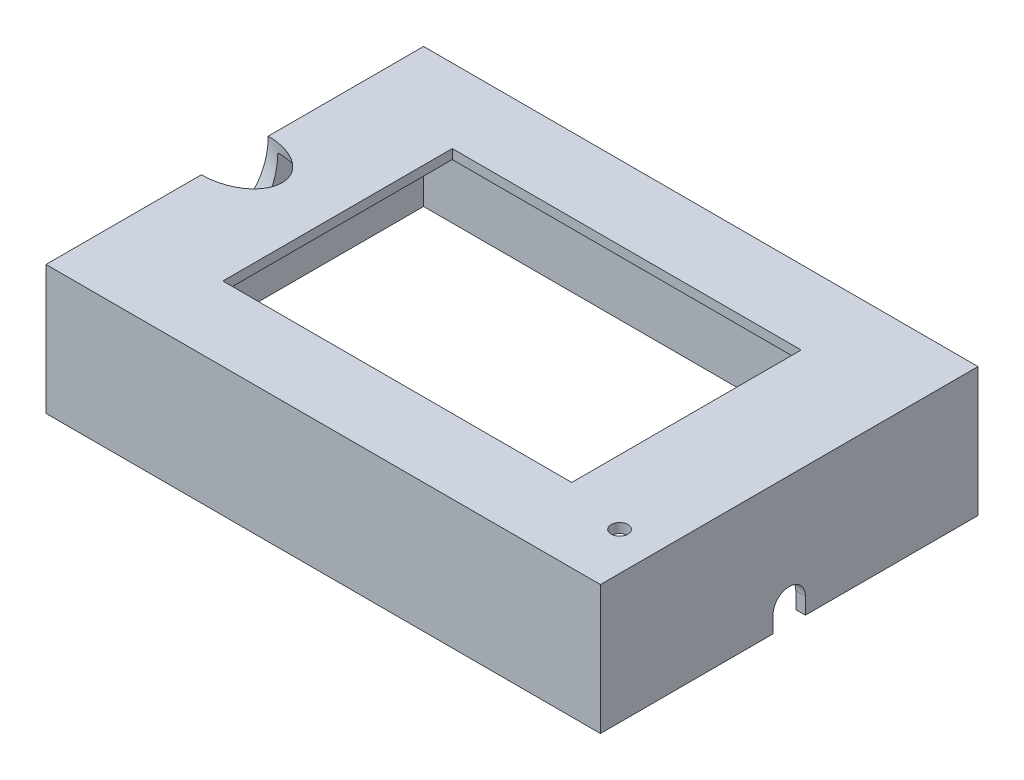
ISO-10303-21;
HEADER;
FILE_DESCRIPTION(('STEP AP214'),'2;1');
FILE_NAME('part.step','',(''),(''),'','','');
FILE_SCHEMA(('AUTOMOTIVE_DESIGN { 1 0 10303 214 1 1 1 1 }'));
ENDSEC;
DATA;
#1=APPLICATION_CONTEXT('core data for automotive mechanical design processes');
#2=APPLICATION_PROTOCOL_DEFINITION('international standard','automotive_design',2000,#1);
#3=PRODUCT_CONTEXT('',#1,'mechanical');
#4=PRODUCT('Part','Part','',(#3));
#5=PRODUCT_RELATED_PRODUCT_CATEGORY('part','',(#4));
#6=PRODUCT_DEFINITION_FORMATION('','',#4);
#7=PRODUCT_DEFINITION_CONTEXT('part definition',#1,'design');
#8=PRODUCT_DEFINITION('design','',#6,#7);
#9=PRODUCT_DEFINITION_SHAPE('','',#8);
#10=(LENGTH_UNIT() NAMED_UNIT(*) SI_UNIT(.MILLI.,.METRE.));
#11=(NAMED_UNIT(*) PLANE_ANGLE_UNIT() SI_UNIT($,.RADIAN.));
#12=(NAMED_UNIT(*) SI_UNIT($,.STERADIAN.) SOLID_ANGLE_UNIT());
#13=UNCERTAINTY_MEASURE_WITH_UNIT(LENGTH_MEASURE(1.E-05),#10,'distance_accuracy_value','');
#14=(GEOMETRIC_REPRESENTATION_CONTEXT(3) GLOBAL_UNCERTAINTY_ASSIGNED_CONTEXT((#13)) GLOBAL_UNIT_ASSIGNED_CONTEXT((#10,
#11,#12)) REPRESENTATION_CONTEXT('',''));
#15=CARTESIAN_POINT('',(0.,0.,0.));
#16=DIRECTION('',(0.,0.,1.));
#17=DIRECTION('',(1.,0.,0.));
#18=AXIS2_PLACEMENT_3D('',#15,#16,#17);
#19=CARTESIAN_POINT('',(-58.,25.,39.5));
#20=DIRECTION('',(1.,0.,0.));
#21=DIRECTION('',(0.,0.,-1.));
#22=AXIS2_PLACEMENT_3D('',#19,#20,#21);
#23=PLANE('',#22);
#24=CARTESIAN_POINT('',(-58.,27.,0.));
#25=DIRECTION('',(1.,0.,0.));
#26=DIRECTION('',(0.,1.,0.));
#27=AXIS2_PLACEMENT_3D('',#24,#25,#26);
#28=ELLIPSE('',#27,9.89949493661166,7.);
#29=CARTESIAN_POINT('',(-58.,27.,-7.));
#30=VERTEX_POINT('',#29);
#31=CARTESIAN_POINT('',(-58.,27.,7.));
#32=VERTEX_POINT('',#31);
#33=EDGE_CURVE('E286',#30,#32,#28,.F.);
#34=ORIENTED_EDGE('',*,*,#33,.F.);
#35=DIRECTION('',(0.,0.,1.));
#36=VECTOR('',#35,1.);
#37=CARTESIAN_POINT('',(-58.,27.,39.5));
#38=LINE('',#37,#36);
#39=CARTESIAN_POINT('',(-58.,27.,-39.5));
#40=VERTEX_POINT('',#39);
#41=EDGE_CURVE('E244',#40,#30,#38,.T.);
#42=ORIENTED_EDGE('',*,*,#41,.F.);
#43=DIRECTION('',(0.,-1.,0.));
#44=VECTOR('',#43,1.);
#45=CARTESIAN_POINT('',(-58.,25.,-39.5));
#46=LINE('',#45,#44);
#47=CARTESIAN_POINT('',(-58.,0.,-39.5));
#48=VERTEX_POINT('',#47);
#49=EDGE_CURVE('E219',#40,#48,#46,.T.);
#50=ORIENTED_EDGE('',*,*,#49,.T.);
#51=DIRECTION('',(0.,0.,1.));
#52=VECTOR('',#51,1.);
#53=CARTESIAN_POINT('',(-58.,0.,39.5));
#54=LINE('',#53,#52);
#55=CARTESIAN_POINT('',(-58.,0.,39.5));
#56=VERTEX_POINT('',#55);
#57=EDGE_CURVE('E209',#48,#56,#54,.T.);
#58=ORIENTED_EDGE('',*,*,#57,.T.);
#59=DIRECTION('',(0.,-1.,0.));
#60=VECTOR('',#59,1.);
#61=CARTESIAN_POINT('',(-58.,25.,39.5));
#62=LINE('',#61,#60);
#63=CARTESIAN_POINT('',(-58.,27.,39.5));
#64=VERTEX_POINT('',#63);
#65=EDGE_CURVE('E216',#64,#56,#62,.T.);
#66=ORIENTED_EDGE('',*,*,#65,.F.);
#67=EDGE_CURVE('E322',#32,#64,#38,.T.);
#68=ORIENTED_EDGE('',*,*,#67,.F.);
#69=EDGE_LOOP('',(#34,#42,#50,#58,#66,#68));
#70=FACE_BOUND('',#69,.T.);
#71=ADVANCED_FACE('F33',(#70),#23,.F.);
#72=CARTESIAN_POINT('',(-56.,25.,37.5));
#73=DIRECTION('',(1.,0.,0.));
#74=DIRECTION('',(0.,0.,-1.));
#75=AXIS2_PLACEMENT_3D('',#72,#73,#74);
#76=PLANE('',#75);
#77=DIRECTION('',(0.,0.,1.));
#78=VECTOR('',#77,1.);
#79=CARTESIAN_POINT('',(-56.,25.,37.5));
#80=LINE('',#79,#78);
#81=CARTESIAN_POINT('',(-56.,25.,-37.5));
#82=VERTEX_POINT('',#81);
#83=CARTESIAN_POINT('',(-56.,25.,-7.));
#84=VERTEX_POINT('',#83);
#85=EDGE_CURVE('E248',#82,#84,#80,.T.);
#86=ORIENTED_EDGE('',*,*,#85,.T.);
#87=CARTESIAN_POINT('',(-56.,25.,0.));
#88=DIRECTION('',(1.,0.,0.));
#89=DIRECTION('',(0.,1.,0.));
#90=AXIS2_PLACEMENT_3D('',#87,#88,#89);
#91=ELLIPSE('',#90,9.89949493661166,7.);
#92=CARTESIAN_POINT('',(-56.,25.,7.));
#93=VERTEX_POINT('',#92);
#94=EDGE_CURVE('E55',#84,#93,#91,.F.);
#95=ORIENTED_EDGE('',*,*,#94,.T.);
#96=CARTESIAN_POINT('',(-56.,25.,37.5));
#97=VERTEX_POINT('',#96);
#98=EDGE_CURVE('E187',#93,#97,#80,.T.);
#99=ORIENTED_EDGE('',*,*,#98,.T.);
#100=DIRECTION('',(0.,-1.,0.));
#101=VECTOR('',#100,1.);
#102=CARTESIAN_POINT('',(-56.,25.,37.5));
#103=LINE('',#102,#101);
#104=CARTESIAN_POINT('',(-56.,0.,37.5));
#105=VERTEX_POINT('',#104);
#106=EDGE_CURVE('E201',#97,#105,#103,.T.);
#107=ORIENTED_EDGE('',*,*,#106,.T.);
#108=DIRECTION('',(0.,0.,1.));
#109=VECTOR('',#108,1.);
#110=CARTESIAN_POINT('',(-56.,0.,37.5));
#111=LINE('',#110,#109);
#112=CARTESIAN_POINT('',(-56.,0.,-37.5));
#113=VERTEX_POINT('',#112);
#114=EDGE_CURVE('E242',#113,#105,#111,.T.);
#115=ORIENTED_EDGE('',*,*,#114,.F.);
#116=DIRECTION('',(0.,-1.,0.));
#117=VECTOR('',#116,1.);
#118=CARTESIAN_POINT('',(-56.,25.,-37.5));
#119=LINE('',#118,#117);
#120=EDGE_CURVE('E192',#82,#113,#119,.T.);
#121=ORIENTED_EDGE('',*,*,#120,.F.);
#122=EDGE_LOOP('',(#86,#95,#99,#107,#115,#121));
#123=FACE_BOUND('',#122,.T.);
#124=ADVANCED_FACE('F261',(#123),#76,.T.);
#125=CARTESIAN_POINT('',(0.,25.,0.));
#126=DIRECTION('',(0.,1.,0.));
#127=DIRECTION('',(0.,0.,1.));
#128=AXIS2_PLACEMENT_3D('',#125,#126,#127);
#129=PLANE('',#128);
#130=DIRECTION('',(-1.,0.,0.));
#131=VECTOR('',#130,1.);
#132=CARTESIAN_POINT('',(-36.5,25.,24.));
#133=LINE('',#132,#131);
#134=CARTESIAN_POINT('',(36.5,25.,24.));
#135=VERTEX_POINT('',#134);
#136=CARTESIAN_POINT('',(-36.5,25.,24.));
#137=VERTEX_POINT('',#136);
#138=EDGE_CURVE('E298',#135,#137,#133,.T.);
#139=ORIENTED_EDGE('',*,*,#138,.F.);
#140=DIRECTION('',(0.,0.,1.));
#141=VECTOR('',#140,1.);
#142=CARTESIAN_POINT('',(36.5,25.,-24.));
#143=LINE('',#142,#141);
#144=CARTESIAN_POINT('',(36.5,25.,-24.));
#145=VERTEX_POINT('',#144);
#146=EDGE_CURVE('E301',#145,#135,#143,.T.);
#147=ORIENTED_EDGE('',*,*,#146,.F.);
#148=DIRECTION('',(1.,0.,0.));
#149=VECTOR('',#148,1.);
#150=CARTESIAN_POINT('',(-36.5,25.,-24.));
#151=LINE('',#150,#149);
#152=CARTESIAN_POINT('',(-36.5,25.,-24.));
#153=VERTEX_POINT('',#152);
#154=EDGE_CURVE('E303',#153,#145,#151,.T.);
#155=ORIENTED_EDGE('',*,*,#154,.F.);
#156=DIRECTION('',(0.,0.,-1.));
#157=VECTOR('',#156,1.);
#158=CARTESIAN_POINT('',(-36.5,25.,-24.));
#159=LINE('',#158,#157);
#160=EDGE_CURVE('E295',#137,#153,#159,.T.);
#161=ORIENTED_EDGE('',*,*,#160,.F.);
#162=EDGE_LOOP('',(#139,#147,#155,#161));
#163=FACE_BOUND('',#162,.T.);
#164=CARTESIAN_POINT('',(50.,25.,27.5));
#165=DIRECTION('',(0.,1.,0.));
#166=DIRECTION('',(0.,0.,1.));
#167=AXIS2_PLACEMENT_3D('',#164,#165,#166);
#168=CIRCLE('',#167,1.75);
#169=CARTESIAN_POINT('',(50.,25.,29.25));
#170=VERTEX_POINT('',#169);
#171=EDGE_CURVE('E291',#170,#170,#168,.F.);
#172=ORIENTED_EDGE('',*,*,#171,.F.);
#173=EDGE_LOOP('',(#172));
#174=FACE_BOUND('',#173,.T.);
#175=CARTESIAN_POINT('',(-56.,25.,0.));
#176=DIRECTION('',(0.,1.,0.));
#177=DIRECTION('',(-1.,0.,0.));
#178=AXIS2_PLACEMENT_3D('',#175,#176,#177);
#179=ELLIPSE('',#178,9.89949493661167,7.);
#180=EDGE_CURVE('E270',#84,#93,#179,.F.);
#181=ORIENTED_EDGE('',*,*,#180,.F.);
#182=ORIENTED_EDGE('',*,*,#85,.F.);
#183=DIRECTION('',(-1.,0.,0.));
#184=VECTOR('',#183,1.);
#185=CARTESIAN_POINT('',(56.,25.,-37.5));
#186=LINE('',#185,#184);
#187=CARTESIAN_POINT('',(56.,25.,-37.5));
#188=VERTEX_POINT('',#187);
#189=EDGE_CURVE('E196',#188,#82,#186,.T.);
#190=ORIENTED_EDGE('',*,*,#189,.F.);
#191=DIRECTION('',(0.,0.,-1.));
#192=VECTOR('',#191,1.);
#193=CARTESIAN_POINT('',(56.,25.,37.5));
#194=LINE('',#193,#192);
#195=CARTESIAN_POINT('',(56.,25.,37.5));
#196=VERTEX_POINT('',#195);
#197=EDGE_CURVE('E254',#196,#188,#194,.T.);
#198=ORIENTED_EDGE('',*,*,#197,.F.);
#199=DIRECTION('',(1.,0.,0.));
#200=VECTOR('',#199,1.);
#201=CARTESIAN_POINT('',(56.,25.,37.5));
#202=LINE('',#201,#200);
#203=EDGE_CURVE('E251',#97,#196,#202,.T.);
#204=ORIENTED_EDGE('',*,*,#203,.F.);
#205=ORIENTED_EDGE('',*,*,#98,.F.);
#206=EDGE_LOOP('',(#181,#182,#190,#198,#204,#205));
#207=FACE_BOUND('',#206,.T.);
#208=ADVANCED_FACE('F267',(#163,#174,#207),#129,.F.);
#209=CARTESIAN_POINT('',(0.,27.,0.));
#210=DIRECTION('',(0.,1.,0.));
#211=DIRECTION('',(0.,0.,1.));
#212=AXIS2_PLACEMENT_3D('',#209,#210,#211);
#213=PLANE('',#212);
#214=DIRECTION('',(0.,0.,-1.));
#215=VECTOR('',#214,1.);
#216=CARTESIAN_POINT('',(36.5,27.,-24.));
#217=LINE('',#216,#215);
#218=CARTESIAN_POINT('',(36.5,27.,24.));
#219=VERTEX_POINT('',#218);
#220=CARTESIAN_POINT('',(36.5,27.,-24.));
#221=VERTEX_POINT('',#220);
#222=EDGE_CURVE('E294',#219,#221,#217,.T.);
#223=ORIENTED_EDGE('',*,*,#222,.F.);
#224=DIRECTION('',(1.,0.,0.));
#225=VECTOR('',#224,1.);
#226=CARTESIAN_POINT('',(-36.5,27.,24.));
#227=LINE('',#226,#225);
#228=CARTESIAN_POINT('',(-36.5,27.,24.));
#229=VERTEX_POINT('',#228);
#230=EDGE_CURVE('E311',#229,#219,#227,.T.);
#231=ORIENTED_EDGE('',*,*,#230,.F.);
#232=DIRECTION('',(0.,0.,1.));
#233=VECTOR('',#232,1.);
#234=CARTESIAN_POINT('',(-36.5,27.,-24.));
#235=LINE('',#234,#233);
#236=CARTESIAN_POINT('',(-36.5,27.,-24.));
#237=VERTEX_POINT('',#236);
#238=EDGE_CURVE('E308',#237,#229,#235,.T.);
#239=ORIENTED_EDGE('',*,*,#238,.F.);
#240=DIRECTION('',(-1.,0.,0.));
#241=VECTOR('',#240,1.);
#242=CARTESIAN_POINT('',(-36.5,27.,-24.));
#243=LINE('',#242,#241);
#244=EDGE_CURVE('E305',#221,#237,#243,.T.);
#245=ORIENTED_EDGE('',*,*,#244,.F.);
#246=EDGE_LOOP('',(#223,#231,#239,#245));
#247=FACE_BOUND('',#246,.T.);
#248=CARTESIAN_POINT('',(50.,27.,27.5));
#249=DIRECTION('',(0.,1.,0.));
#250=DIRECTION('',(0.,0.,1.));
#251=AXIS2_PLACEMENT_3D('',#248,#249,#250);
#252=CIRCLE('',#251,1.75);
#253=CARTESIAN_POINT('',(50.,27.,29.25));
#254=VERTEX_POINT('',#253);
#255=EDGE_CURVE('E271',#254,#254,#252,.T.);
#256=ORIENTED_EDGE('',*,*,#255,.F.);
#257=EDGE_LOOP('',(#256));
#258=FACE_BOUND('',#257,.T.);
#259=ORIENTED_EDGE('',*,*,#41,.T.);
#260=CARTESIAN_POINT('',(-58.,27.,0.));
#261=DIRECTION('',(0.,1.,0.));
#262=DIRECTION('',(-1.,0.,0.));
#263=AXIS2_PLACEMENT_3D('',#260,#261,#262);
#264=ELLIPSE('',#263,9.89949493661167,7.);
#265=EDGE_CURVE('E11',#30,#32,#264,.F.);
#266=ORIENTED_EDGE('',*,*,#265,.T.);
#267=ORIENTED_EDGE('',*,*,#67,.T.);
#268=DIRECTION('',(1.,0.,0.));
#269=VECTOR('',#268,1.);
#270=CARTESIAN_POINT('',(58.,27.,39.5));
#271=LINE('',#270,#269);
#272=CARTESIAN_POINT('',(58.,27.,39.5));
#273=VERTEX_POINT('',#272);
#274=EDGE_CURVE('E240',#64,#273,#271,.T.);
#275=ORIENTED_EDGE('',*,*,#274,.T.);
#276=DIRECTION('',(0.,0.,-1.));
#277=VECTOR('',#276,1.);
#278=CARTESIAN_POINT('',(58.,27.,39.5));
#279=LINE('',#278,#277);
#280=CARTESIAN_POINT('',(58.,27.,-39.5));
#281=VERTEX_POINT('',#280);
#282=EDGE_CURVE('E231',#273,#281,#279,.T.);
#283=ORIENTED_EDGE('',*,*,#282,.T.);
#284=DIRECTION('',(-1.,0.,0.));
#285=VECTOR('',#284,1.);
#286=CARTESIAN_POINT('',(58.,27.,-39.5));
#287=LINE('',#286,#285);
#288=EDGE_CURVE('E227',#281,#40,#287,.T.);
#289=ORIENTED_EDGE('',*,*,#288,.T.);
#290=EDGE_LOOP('',(#259,#266,#267,#275,#283,#289));
#291=FACE_BOUND('',#290,.T.);
#292=ADVANCED_FACE('F237',(#247,#258,#291),#213,.T.);
#293=CARTESIAN_POINT('',(0.,0.,0.));
#294=DIRECTION('',(0.,1.,0.));
#295=DIRECTION('',(0.,0.,1.));
#296=AXIS2_PLACEMENT_3D('',#293,#294,#295);
#297=PLANE('',#296);
#298=DIRECTION('',(0.,0.,-1.));
#299=VECTOR('',#298,1.);
#300=CARTESIAN_POINT('',(56.,0.,37.5));
#301=LINE('',#300,#299);
#302=CARTESIAN_POINT('',(56.,0.,37.5));
#303=VERTEX_POINT('',#302);
#304=CARTESIAN_POINT('',(56.,0.,3.375));
#305=VERTEX_POINT('',#304);
#306=EDGE_CURVE('E174',#303,#305,#301,.T.);
#307=ORIENTED_EDGE('',*,*,#306,.T.);
#308=DIRECTION('',(1.,0.,0.));
#309=VECTOR('',#308,1.);
#310=CARTESIAN_POINT('',(46.3652646637284,0.,3.375));
#311=LINE('',#310,#309);
#312=CARTESIAN_POINT('',(58.,0.,3.375));
#313=VERTEX_POINT('',#312);
#314=EDGE_CURVE('E157',#305,#313,#311,.T.);
#315=ORIENTED_EDGE('',*,*,#314,.T.);
#316=DIRECTION('',(0.,0.,-1.));
#317=VECTOR('',#316,1.);
#318=CARTESIAN_POINT('',(58.,0.,39.5));
#319=LINE('',#318,#317);
#320=CARTESIAN_POINT('',(58.,0.,39.5));
#321=VERTEX_POINT('',#320);
#322=EDGE_CURVE('E205',#321,#313,#319,.T.);
#323=ORIENTED_EDGE('',*,*,#322,.F.);
#324=DIRECTION('',(1.,0.,0.));
#325=VECTOR('',#324,1.);
#326=CARTESIAN_POINT('',(58.,0.,39.5));
#327=LINE('',#326,#325);
#328=EDGE_CURVE('E211',#56,#321,#327,.T.);
#329=ORIENTED_EDGE('',*,*,#328,.F.);
#330=ORIENTED_EDGE('',*,*,#57,.F.);
#331=DIRECTION('',(-1.,0.,0.));
#332=VECTOR('',#331,1.);
#333=CARTESIAN_POINT('',(58.,0.,-39.5));
#334=LINE('',#333,#332);
#335=CARTESIAN_POINT('',(58.,0.,-39.5));
#336=VERTEX_POINT('',#335);
#337=EDGE_CURVE('E207',#336,#48,#334,.T.);
#338=ORIENTED_EDGE('',*,*,#337,.F.);
#339=CARTESIAN_POINT('',(58.,0.,-3.375));
#340=VERTEX_POINT('',#339);
#341=EDGE_CURVE('E204',#340,#336,#319,.T.);
#342=ORIENTED_EDGE('',*,*,#341,.F.);
#343=DIRECTION('',(1.,0.,0.));
#344=VECTOR('',#343,1.);
#345=CARTESIAN_POINT('',(46.3652646637284,0.,-3.375));
#346=LINE('',#345,#344);
#347=CARTESIAN_POINT('',(56.,0.,-3.375));
#348=VERTEX_POINT('',#347);
#349=EDGE_CURVE('E168',#348,#340,#346,.T.);
#350=ORIENTED_EDGE('',*,*,#349,.F.);
#351=CARTESIAN_POINT('',(56.,0.,-37.5));
#352=VERTEX_POINT('',#351);
#353=EDGE_CURVE('E184',#348,#352,#301,.T.);
#354=ORIENTED_EDGE('',*,*,#353,.T.);
#355=DIRECTION('',(-1.,0.,0.));
#356=VECTOR('',#355,1.);
#357=CARTESIAN_POINT('',(56.,0.,-37.5));
#358=LINE('',#357,#356);
#359=EDGE_CURVE('E183',#352,#113,#358,.T.);
#360=ORIENTED_EDGE('',*,*,#359,.T.);
#361=ORIENTED_EDGE('',*,*,#114,.T.);
#362=DIRECTION('',(1.,0.,0.));
#363=VECTOR('',#362,1.);
#364=CARTESIAN_POINT('',(56.,0.,37.5));
#365=LINE('',#364,#363);
#366=EDGE_CURVE('E182',#105,#303,#365,.T.);
#367=ORIENTED_EDGE('',*,*,#366,.T.);
#368=EDGE_LOOP('',(#307,#315,#323,#329,#330,#338,#342,#350,#354,#360,#361,#367));
#369=FACE_BOUND('',#368,.T.);
#370=ADVANCED_FACE('F180',(#369),#297,.F.);
#371=CARTESIAN_POINT('',(58.,25.,39.5));
#372=DIRECTION('',(-1.,0.,0.));
#373=DIRECTION('',(0.,0.,1.));
#374=AXIS2_PLACEMENT_3D('',#371,#372,#373);
#375=PLANE('',#374);
#376=ORIENTED_EDGE('',*,*,#322,.T.);
#377=DIRECTION('',(0.,-1.,0.));
#378=VECTOR('',#377,1.);
#379=CARTESIAN_POINT('',(58.,3.5,3.375));
#380=LINE('',#379,#378);
#381=CARTESIAN_POINT('',(58.,3.5,3.375));
#382=VERTEX_POINT('',#381);
#383=EDGE_CURVE('E163',#382,#313,#380,.T.);
#384=ORIENTED_EDGE('',*,*,#383,.F.);
#385=CARTESIAN_POINT('',(58.,3.5,0.));
#386=DIRECTION('',(1.,0.,0.));
#387=DIRECTION('',(0.,0.,-1.));
#388=AXIS2_PLACEMENT_3D('',#385,#386,#387);
#389=CIRCLE('',#388,3.375);
#390=CARTESIAN_POINT('',(58.,3.5,-3.375));
#391=VERTEX_POINT('',#390);
#392=EDGE_CURVE('E332',#391,#382,#389,.T.);
#393=ORIENTED_EDGE('',*,*,#392,.F.);
#394=DIRECTION('',(0.,1.,0.));
#395=VECTOR('',#394,1.);
#396=CARTESIAN_POINT('',(58.,3.5,-3.375));
#397=LINE('',#396,#395);
#398=EDGE_CURVE('E178',#340,#391,#397,.T.);
#399=ORIENTED_EDGE('',*,*,#398,.F.);
#400=ORIENTED_EDGE('',*,*,#341,.T.);
#401=DIRECTION('',(0.,-1.,0.));
#402=VECTOR('',#401,1.);
#403=CARTESIAN_POINT('',(58.,25.,-39.5));
#404=LINE('',#403,#402);
#405=EDGE_CURVE('E41',#281,#336,#404,.T.);
#406=ORIENTED_EDGE('',*,*,#405,.F.);
#407=ORIENTED_EDGE('',*,*,#282,.F.);
#408=DIRECTION('',(0.,-1.,0.));
#409=VECTOR('',#408,1.);
#410=CARTESIAN_POINT('',(58.,25.,39.5));
#411=LINE('',#410,#409);
#412=EDGE_CURVE('E213',#273,#321,#411,.T.);
#413=ORIENTED_EDGE('',*,*,#412,.T.);
#414=EDGE_LOOP('',(#376,#384,#393,#399,#400,#406,#407,#413));
#415=FACE_BOUND('',#414,.T.);
#416=ADVANCED_FACE('F35',(#415),#375,.F.);
#417=CARTESIAN_POINT('',(58.,25.,-39.5));
#418=DIRECTION('',(0.,0.,1.));
#419=DIRECTION('',(1.,0.,0.));
#420=AXIS2_PLACEMENT_3D('',#417,#418,#419);
#421=PLANE('',#420);
#422=ORIENTED_EDGE('',*,*,#337,.T.);
#423=ORIENTED_EDGE('',*,*,#49,.F.);
#424=ORIENTED_EDGE('',*,*,#288,.F.);
#425=ORIENTED_EDGE('',*,*,#405,.T.);
#426=EDGE_LOOP('',(#422,#423,#424,#425));
#427=FACE_BOUND('',#426,.T.);
#428=ADVANCED_FACE('F224',(#427),#421,.F.);
#429=CARTESIAN_POINT('',(58.,25.,39.5));
#430=DIRECTION('',(0.,0.,-1.));
#431=DIRECTION('',(-1.,0.,0.));
#432=AXIS2_PLACEMENT_3D('',#429,#430,#431);
#433=PLANE('',#432);
#434=ORIENTED_EDGE('',*,*,#328,.T.);
#435=ORIENTED_EDGE('',*,*,#412,.F.);
#436=ORIENTED_EDGE('',*,*,#274,.F.);
#437=ORIENTED_EDGE('',*,*,#65,.T.);
#438=EDGE_LOOP('',(#434,#435,#436,#437));
#439=FACE_BOUND('',#438,.T.);
#440=ADVANCED_FACE('F330',(#439),#433,.F.);
#441=CARTESIAN_POINT('',(56.,25.,37.5));
#442=DIRECTION('',(0.,0.,-1.));
#443=DIRECTION('',(-1.,0.,0.));
#444=AXIS2_PLACEMENT_3D('',#441,#442,#443);
#445=PLANE('',#444);
#446=ORIENTED_EDGE('',*,*,#366,.F.);
#447=ORIENTED_EDGE('',*,*,#106,.F.);
#448=ORIENTED_EDGE('',*,*,#203,.T.);
#449=DIRECTION('',(0.,-1.,0.));
#450=VECTOR('',#449,1.);
#451=CARTESIAN_POINT('',(56.,25.,37.5));
#452=LINE('',#451,#450);
#453=EDGE_CURVE('E199',#196,#303,#452,.T.);
#454=ORIENTED_EDGE('',*,*,#453,.T.);
#455=EDGE_LOOP('',(#446,#447,#448,#454));
#456=FACE_BOUND('',#455,.T.);
#457=ADVANCED_FACE('F274',(#456),#445,.T.);
#458=CARTESIAN_POINT('',(56.,25.,37.5));
#459=DIRECTION('',(-1.,0.,0.));
#460=DIRECTION('',(0.,0.,1.));
#461=AXIS2_PLACEMENT_3D('',#458,#459,#460);
#462=PLANE('',#461);
#463=DIRECTION('',(0.,-1.,0.));
#464=VECTOR('',#463,1.);
#465=CARTESIAN_POINT('',(56.,3.5,3.375));
#466=LINE('',#465,#464);
#467=CARTESIAN_POINT('',(56.,3.5,3.37499999999999));
#468=VERTEX_POINT('',#467);
#469=EDGE_CURVE('E160',#468,#305,#466,.T.);
#470=ORIENTED_EDGE('',*,*,#469,.T.);
#471=ORIENTED_EDGE('',*,*,#306,.F.);
#472=ORIENTED_EDGE('',*,*,#453,.F.);
#473=ORIENTED_EDGE('',*,*,#197,.T.);
#474=DIRECTION('',(0.,-1.,0.));
#475=VECTOR('',#474,1.);
#476=CARTESIAN_POINT('',(56.,25.,-37.5));
#477=LINE('',#476,#475);
#478=EDGE_CURVE('E195',#188,#352,#477,.T.);
#479=ORIENTED_EDGE('',*,*,#478,.T.);
#480=ORIENTED_EDGE('',*,*,#353,.F.);
#481=DIRECTION('',(0.,1.,0.));
#482=VECTOR('',#481,1.);
#483=CARTESIAN_POINT('',(56.,3.5,-3.375));
#484=LINE('',#483,#482);
#485=CARTESIAN_POINT('',(56.,3.5,-3.375));
#486=VERTEX_POINT('',#485);
#487=EDGE_CURVE('E276',#348,#486,#484,.T.);
#488=ORIENTED_EDGE('',*,*,#487,.T.);
#489=CARTESIAN_POINT('',(56.,3.5,0.));
#490=DIRECTION('',(-1.,0.,0.));
#491=DIRECTION('',(0.,0.,1.));
#492=AXIS2_PLACEMENT_3D('',#489,#490,#491);
#493=CIRCLE('',#492,3.375);
#494=EDGE_CURVE('E177',#486,#468,#493,.F.);
#495=ORIENTED_EDGE('',*,*,#494,.T.);
#496=EDGE_LOOP('',(#470,#471,#472,#473,#479,#480,#488,#495));
#497=FACE_BOUND('',#496,.T.);
#498=ADVANCED_FACE('F172',(#497),#462,.T.);
#499=CARTESIAN_POINT('',(56.,25.,-37.5));
#500=DIRECTION('',(0.,0.,1.));
#501=DIRECTION('',(1.,0.,0.));
#502=AXIS2_PLACEMENT_3D('',#499,#500,#501);
#503=PLANE('',#502);
#504=ORIENTED_EDGE('',*,*,#359,.F.);
#505=ORIENTED_EDGE('',*,*,#478,.F.);
#506=ORIENTED_EDGE('',*,*,#189,.T.);
#507=ORIENTED_EDGE('',*,*,#120,.T.);
#508=EDGE_LOOP('',(#504,#505,#506,#507));
#509=FACE_BOUND('',#508,.T.);
#510=ADVANCED_FACE('F264',(#509),#503,.T.);
#511=CARTESIAN_POINT('',(36.5,-62.3670418407308,-24.));
#512=DIRECTION('',(1.,0.,0.));
#513=DIRECTION('',(0.,0.,-1.));
#514=AXIS2_PLACEMENT_3D('',#511,#512,#513);
#515=PLANE('',#514);
#516=ORIENTED_EDGE('',*,*,#146,.T.);
#517=DIRECTION('',(0.,1.,0.));
#518=VECTOR('',#517,1.);
#519=CARTESIAN_POINT('',(36.5,-62.3670418407308,24.));
#520=LINE('',#519,#518);
#521=EDGE_CURVE('E299',#135,#219,#520,.T.);
#522=ORIENTED_EDGE('',*,*,#521,.T.);
#523=ORIENTED_EDGE('',*,*,#222,.T.);
#524=DIRECTION('',(0.,1.,0.));
#525=VECTOR('',#524,1.);
#526=CARTESIAN_POINT('',(36.5,-62.3670418407308,-24.));
#527=LINE('',#526,#525);
#528=EDGE_CURVE('E314',#145,#221,#527,.T.);
#529=ORIENTED_EDGE('',*,*,#528,.F.);
#530=EDGE_LOOP('',(#516,#522,#523,#529));
#531=FACE_BOUND('',#530,.T.);
#532=ADVANCED_FACE('F377',(#531),#515,.F.);
#533=CARTESIAN_POINT('',(-36.5,-62.3670418407308,24.));
#534=DIRECTION('',(0.,0.,1.));
#535=DIRECTION('',(1.,0.,0.));
#536=AXIS2_PLACEMENT_3D('',#533,#534,#535);
#537=PLANE('',#536);
#538=ORIENTED_EDGE('',*,*,#138,.T.);
#539=DIRECTION('',(0.,1.,0.));
#540=VECTOR('',#539,1.);
#541=CARTESIAN_POINT('',(-36.5,-62.3670418407308,24.));
#542=LINE('',#541,#540);
#543=EDGE_CURVE('E316',#137,#229,#542,.T.);
#544=ORIENTED_EDGE('',*,*,#543,.T.);
#545=ORIENTED_EDGE('',*,*,#230,.T.);
#546=ORIENTED_EDGE('',*,*,#521,.F.);
#547=EDGE_LOOP('',(#538,#544,#545,#546));
#548=FACE_BOUND('',#547,.T.);
#549=ADVANCED_FACE('F383',(#548),#537,.F.);
#550=CARTESIAN_POINT('',(-36.5,-62.3670418407308,-24.));
#551=DIRECTION('',(-1.,0.,0.));
#552=DIRECTION('',(0.,0.,1.));
#553=AXIS2_PLACEMENT_3D('',#550,#551,#552);
#554=PLANE('',#553);
#555=ORIENTED_EDGE('',*,*,#160,.T.);
#556=DIRECTION('',(0.,1.,0.));
#557=VECTOR('',#556,1.);
#558=CARTESIAN_POINT('',(-36.5,-62.3670418407308,-24.));
#559=LINE('',#558,#557);
#560=EDGE_CURVE('E318',#153,#237,#559,.T.);
#561=ORIENTED_EDGE('',*,*,#560,.T.);
#562=ORIENTED_EDGE('',*,*,#238,.T.);
#563=ORIENTED_EDGE('',*,*,#543,.F.);
#564=EDGE_LOOP('',(#555,#561,#562,#563));
#565=FACE_BOUND('',#564,.T.);
#566=ADVANCED_FACE('F389',(#565),#554,.F.);
#567=CARTESIAN_POINT('',(-36.5,-62.3670418407308,-24.));
#568=DIRECTION('',(0.,0.,-1.));
#569=DIRECTION('',(-1.,0.,0.));
#570=AXIS2_PLACEMENT_3D('',#567,#568,#569);
#571=PLANE('',#570);
#572=ORIENTED_EDGE('',*,*,#154,.T.);
#573=ORIENTED_EDGE('',*,*,#528,.T.);
#574=ORIENTED_EDGE('',*,*,#244,.T.);
#575=ORIENTED_EDGE('',*,*,#560,.F.);
#576=EDGE_LOOP('',(#572,#573,#574,#575));
#577=FACE_BOUND('',#576,.T.);
#578=ADVANCED_FACE('F385',(#577),#571,.F.);
#579=CARTESIAN_POINT('',(50.,20.0502525316942,27.5));
#580=DIRECTION('',(0.,1.,0.));
#581=DIRECTION('',(0.,0.,1.));
#582=AXIS2_PLACEMENT_3D('',#579,#580,#581);
#583=CYLINDRICAL_SURFACE('',#582,1.75);
#584=ORIENTED_EDGE('',*,*,#171,.T.);
#585=EDGE_LOOP('',(#584));
#586=FACE_BOUND('',#585,.T.);
#587=ORIENTED_EDGE('',*,*,#255,.T.);
#588=EDGE_LOOP('',(#587));
#589=FACE_BOUND('',#588,.T.);
#590=ADVANCED_FACE('F388',(#586,#589),#583,.F.);
#591=CARTESIAN_POINT('',(-50.9289321881345,19.9289321881345,0.));
#592=DIRECTION('',(-0.707106781186548,0.707106781186547,0.));
#593=DIRECTION('',(-0.707106781186547,-0.707106781186548,0.));
#594=AXIS2_PLACEMENT_3D('',#591,#592,#593);
#595=CYLINDRICAL_SURFACE('',#594,7.);
#596=ORIENTED_EDGE('',*,*,#180,.T.);
#597=ORIENTED_EDGE('',*,*,#94,.F.);
#598=EDGE_LOOP('',(#596,#597));
#599=FACE_BOUND('',#598,.T.);
#600=ORIENTED_EDGE('',*,*,#33,.T.);
#601=ORIENTED_EDGE('',*,*,#265,.F.);
#602=EDGE_LOOP('',(#600,#601));
#603=FACE_BOUND('',#602,.T.);
#604=ADVANCED_FACE('F347',(#599,#603),#595,.F.);
#605=CARTESIAN_POINT('',(46.3652646637284,3.5,3.375));
#606=DIRECTION('',(0.,0.,1.));
#607=DIRECTION('',(0.,-1.,0.));
#608=AXIS2_PLACEMENT_3D('',#605,#606,#607);
#609=PLANE('',#608);
#610=DIRECTION('',(1.,0.,0.));
#611=VECTOR('',#610,1.);
#612=CARTESIAN_POINT('',(46.3652646637284,3.5,3.375));
#613=LINE('',#612,#611);
#614=EDGE_CURVE('E48',#468,#382,#613,.T.);
#615=ORIENTED_EDGE('',*,*,#614,.T.);
#616=ORIENTED_EDGE('',*,*,#383,.T.);
#617=ORIENTED_EDGE('',*,*,#314,.F.);
#618=ORIENTED_EDGE('',*,*,#469,.F.);
#619=EDGE_LOOP('',(#615,#616,#617,#618));
#620=FACE_BOUND('',#619,.T.);
#621=ADVANCED_FACE('F159',(#620),#609,.F.);
#622=CARTESIAN_POINT('',(46.3652646637284,3.5,-3.375));
#623=DIRECTION('',(0.,0.,-1.));
#624=DIRECTION('',(0.,1.,0.));
#625=AXIS2_PLACEMENT_3D('',#622,#623,#624);
#626=PLANE('',#625);
#627=ORIENTED_EDGE('',*,*,#349,.T.);
#628=ORIENTED_EDGE('',*,*,#398,.T.);
#629=DIRECTION('',(1.,0.,0.));
#630=VECTOR('',#629,1.);
#631=CARTESIAN_POINT('',(46.3652646637284,3.5,-3.375));
#632=LINE('',#631,#630);
#633=EDGE_CURVE('E281',#486,#391,#632,.T.);
#634=ORIENTED_EDGE('',*,*,#633,.F.);
#635=ORIENTED_EDGE('',*,*,#487,.F.);
#636=EDGE_LOOP('',(#627,#628,#634,#635));
#637=FACE_BOUND('',#636,.T.);
#638=ADVANCED_FACE('F339',(#637),#626,.F.);
#639=CARTESIAN_POINT('',(46.3652646637284,3.5,0.));
#640=DIRECTION('',(1.,0.,0.));
#641=DIRECTION('',(0.,0.,-1.));
#642=AXIS2_PLACEMENT_3D('',#639,#640,#641);
#643=CYLINDRICAL_SURFACE('',#642,3.375);
#644=ORIENTED_EDGE('',*,*,#633,.T.);
#645=ORIENTED_EDGE('',*,*,#392,.T.);
#646=ORIENTED_EDGE('',*,*,#614,.F.);
#647=ORIENTED_EDGE('',*,*,#494,.F.);
#648=EDGE_LOOP('',(#644,#645,#646,#647));
#649=FACE_BOUND('',#648,.T.);
#650=ADVANCED_FACE('F338',(#649),#643,.F.);
#651=CLOSED_SHELL('',(#71,#124,#208,#292,#370,#416,#428,#440,#457,#498,#510,#532,#549,#566,#578,
#590,#604,#621,#638,#650));
#652=MANIFOLD_SOLID_BREP('B2',#651);
#653=ADVANCED_BREP_SHAPE_REPRESENTATION('',(#18,#652),#14);
#654=SHAPE_DEFINITION_REPRESENTATION(#9,#653);
ENDSEC;
END-ISO-10303-21;
